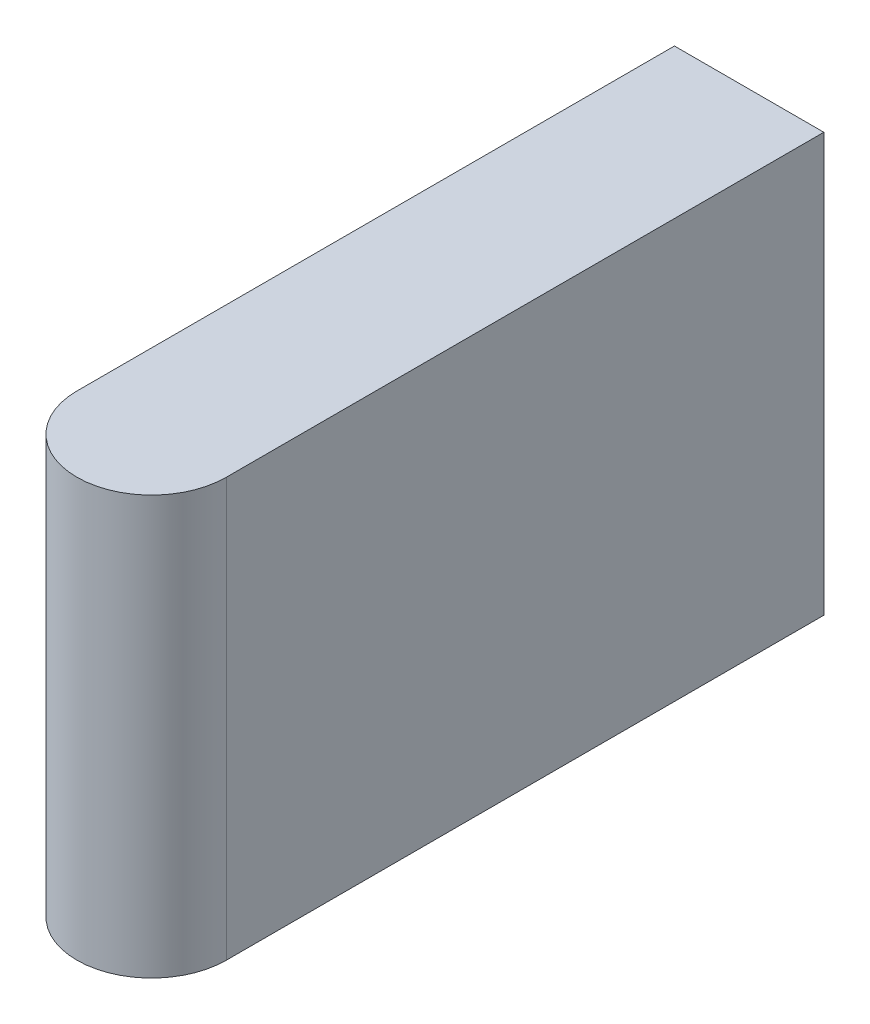
ISO-10303-21;
HEADER;
FILE_DESCRIPTION(('STEP AP214'),'2;1');
FILE_NAME('part.step','',(''),(''),'','','');
FILE_SCHEMA(('AUTOMOTIVE_DESIGN { 1 0 10303 214 1 1 1 1 }'));
ENDSEC;
DATA;
#1=APPLICATION_CONTEXT('core data for automotive mechanical design processes');
#2=APPLICATION_PROTOCOL_DEFINITION('international standard','automotive_design',2000,#1);
#3=PRODUCT_CONTEXT('',#1,'mechanical');
#4=PRODUCT('Part','Part','',(#3));
#5=PRODUCT_RELATED_PRODUCT_CATEGORY('part','',(#4));
#6=PRODUCT_DEFINITION_FORMATION('','',#4);
#7=PRODUCT_DEFINITION_CONTEXT('part definition',#1,'design');
#8=PRODUCT_DEFINITION('design','',#6,#7);
#9=PRODUCT_DEFINITION_SHAPE('','',#8);
#10=(LENGTH_UNIT() NAMED_UNIT(*) SI_UNIT(.MILLI.,.METRE.));
#11=(NAMED_UNIT(*) PLANE_ANGLE_UNIT() SI_UNIT($,.RADIAN.));
#12=(NAMED_UNIT(*) SI_UNIT($,.STERADIAN.) SOLID_ANGLE_UNIT());
#13=UNCERTAINTY_MEASURE_WITH_UNIT(LENGTH_MEASURE(1.E-05),#10,'distance_accuracy_value','');
#14=(GEOMETRIC_REPRESENTATION_CONTEXT(3) GLOBAL_UNCERTAINTY_ASSIGNED_CONTEXT((#13)) GLOBAL_UNIT_ASSIGNED_CONTEXT((#10,
#11,#12)) REPRESENTATION_CONTEXT('',''));
#15=CARTESIAN_POINT('',(0.,0.,0.));
#16=DIRECTION('',(0.,0.,1.));
#17=DIRECTION('',(1.,0.,0.));
#18=AXIS2_PLACEMENT_3D('',#15,#16,#17);
#19=CARTESIAN_POINT('',(-0.499999999999999,1.4,0.));
#20=DIRECTION('',(0.,0.,1.));
#21=DIRECTION('',(1.,0.,0.));
#22=AXIS2_PLACEMENT_3D('',#19,#20,#21);
#23=PLANE('',#22);
#24=DIRECTION('',(-1.,0.,0.));
#25=VECTOR('',#24,1.);
#26=CARTESIAN_POINT('',(-0.499999999999999,-1.4,0.));
#27=LINE('',#26,#25);
#28=CARTESIAN_POINT('',(0.500000000000002,-1.4,0.));
#29=VERTEX_POINT('',#28);
#30=CARTESIAN_POINT('',(-0.499999999999999,-1.4,0.));
#31=VERTEX_POINT('',#30);
#32=EDGE_CURVE('E76',#29,#31,#27,.T.);
#33=ORIENTED_EDGE('',*,*,#32,.T.);
#34=DIRECTION('',(0.,-1.,0.));
#35=VECTOR('',#34,1.);
#36=CARTESIAN_POINT('',(-0.499999999999999,1.4,0.));
#37=LINE('',#36,#35);
#38=CARTESIAN_POINT('',(-0.499999999999999,1.4,0.));
#39=VERTEX_POINT('',#38);
#40=EDGE_CURVE('E11',#39,#31,#37,.T.);
#41=ORIENTED_EDGE('',*,*,#40,.F.);
#42=DIRECTION('',(-1.,0.,0.));
#43=VECTOR('',#42,1.);
#44=CARTESIAN_POINT('',(-0.499999999999999,1.4,0.));
#45=LINE('',#44,#43);
#46=CARTESIAN_POINT('',(0.500000000000002,1.4,0.));
#47=VERTEX_POINT('',#46);
#48=EDGE_CURVE('E94',#47,#39,#45,.T.);
#49=ORIENTED_EDGE('',*,*,#48,.F.);
#50=DIRECTION('',(0.,-1.,0.));
#51=VECTOR('',#50,1.);
#52=CARTESIAN_POINT('',(0.500000000000002,1.4,0.));
#53=LINE('',#52,#51);
#54=EDGE_CURVE('E88',#47,#29,#53,.T.);
#55=ORIENTED_EDGE('',*,*,#54,.T.);
#56=EDGE_LOOP('',(#33,#41,#49,#55));
#57=FACE_BOUND('',#56,.T.);
#58=ADVANCED_FACE('F32',(#57),#23,.F.);
#59=CARTESIAN_POINT('',(-0.499999999999999,1.4,0.));
#60=DIRECTION('',(1.,0.,0.));
#61=DIRECTION('',(0.,0.,-1.));
#62=AXIS2_PLACEMENT_3D('',#59,#60,#61);
#63=PLANE('',#62);
#64=DIRECTION('',(0.,0.,1.));
#65=VECTOR('',#64,1.);
#66=CARTESIAN_POINT('',(-0.499999999999999,-1.4,0.));
#67=LINE('',#66,#65);
#68=CARTESIAN_POINT('',(-0.5,-1.4,4.));
#69=VERTEX_POINT('',#68);
#70=EDGE_CURVE('E72',#31,#69,#67,.T.);
#71=ORIENTED_EDGE('',*,*,#70,.T.);
#72=DIRECTION('',(0.,-1.,0.));
#73=VECTOR('',#72,1.);
#74=CARTESIAN_POINT('',(-0.5,1.4,4.));
#75=LINE('',#74,#73);
#76=CARTESIAN_POINT('',(-0.5,1.4,4.));
#77=VERTEX_POINT('',#76);
#78=EDGE_CURVE('E39',#77,#69,#75,.T.);
#79=ORIENTED_EDGE('',*,*,#78,.F.);
#80=DIRECTION('',(0.,0.,1.));
#81=VECTOR('',#80,1.);
#82=CARTESIAN_POINT('',(-0.499999999999999,1.4,0.));
#83=LINE('',#82,#81);
#84=EDGE_CURVE('E84',#39,#77,#83,.T.);
#85=ORIENTED_EDGE('',*,*,#84,.F.);
#86=ORIENTED_EDGE('',*,*,#40,.T.);
#87=EDGE_LOOP('',(#71,#79,#85,#86));
#88=FACE_BOUND('',#87,.T.);
#89=ADVANCED_FACE('F83',(#88),#63,.F.);
#90=CARTESIAN_POINT('',(0.,1.4,4.));
#91=DIRECTION('',(0.,-1.,0.));
#92=DIRECTION('',(0.,0.,-1.));
#93=AXIS2_PLACEMENT_3D('',#90,#91,#92);
#94=CYLINDRICAL_SURFACE('',#93,0.5);
#95=CARTESIAN_POINT('',(0.,-1.4,4.));
#96=DIRECTION('',(0.,1.,0.));
#97=DIRECTION('',(0.,0.,1.));
#98=AXIS2_PLACEMENT_3D('',#95,#96,#97);
#99=CIRCLE('',#98,0.5);
#100=CARTESIAN_POINT('',(0.500000000000001,-1.4,4.));
#101=VERTEX_POINT('',#100);
#102=EDGE_CURVE('E77',#69,#101,#99,.T.);
#103=ORIENTED_EDGE('',*,*,#102,.T.);
#104=DIRECTION('',(0.,-1.,0.));
#105=VECTOR('',#104,1.);
#106=CARTESIAN_POINT('',(0.500000000000001,1.4,4.));
#107=LINE('',#106,#105);
#108=CARTESIAN_POINT('',(0.500000000000001,1.4,4.));
#109=VERTEX_POINT('',#108);
#110=EDGE_CURVE('E100',#109,#101,#107,.T.);
#111=ORIENTED_EDGE('',*,*,#110,.F.);
#112=CARTESIAN_POINT('',(0.,1.4,4.));
#113=DIRECTION('',(0.,1.,0.));
#114=DIRECTION('',(0.,0.,1.));
#115=AXIS2_PLACEMENT_3D('',#112,#113,#114);
#116=CIRCLE('',#115,0.5);
#117=EDGE_CURVE('E51',#77,#109,#116,.T.);
#118=ORIENTED_EDGE('',*,*,#117,.F.);
#119=ORIENTED_EDGE('',*,*,#78,.T.);
#120=EDGE_LOOP('',(#103,#111,#118,#119));
#121=FACE_BOUND('',#120,.T.);
#122=ADVANCED_FACE('F103',(#121),#94,.T.);
#123=CARTESIAN_POINT('',(0.500000000000002,1.4,0.));
#124=DIRECTION('',(-1.,0.,0.));
#125=DIRECTION('',(0.,0.,1.));
#126=AXIS2_PLACEMENT_3D('',#123,#124,#125);
#127=PLANE('',#126);
#128=DIRECTION('',(0.,0.,-1.));
#129=VECTOR('',#128,1.);
#130=CARTESIAN_POINT('',(0.500000000000002,-1.4,0.));
#131=LINE('',#130,#129);
#132=EDGE_CURVE('E92',#101,#29,#131,.T.);
#133=ORIENTED_EDGE('',*,*,#132,.T.);
#134=ORIENTED_EDGE('',*,*,#54,.F.);
#135=DIRECTION('',(0.,0.,-1.));
#136=VECTOR('',#135,1.);
#137=CARTESIAN_POINT('',(0.500000000000002,1.4,0.));
#138=LINE('',#137,#136);
#139=EDGE_CURVE('E46',#109,#47,#138,.T.);
#140=ORIENTED_EDGE('',*,*,#139,.F.);
#141=ORIENTED_EDGE('',*,*,#110,.T.);
#142=EDGE_LOOP('',(#133,#134,#140,#141));
#143=FACE_BOUND('',#142,.T.);
#144=ADVANCED_FACE('F105',(#143),#127,.F.);
#145=CARTESIAN_POINT('',(0.,1.4,4.));
#146=DIRECTION('',(0.,1.,0.));
#147=DIRECTION('',(0.,0.,1.));
#148=AXIS2_PLACEMENT_3D('',#145,#146,#147);
#149=PLANE('',#148);
#150=ORIENTED_EDGE('',*,*,#48,.T.);
#151=ORIENTED_EDGE('',*,*,#84,.T.);
#152=ORIENTED_EDGE('',*,*,#117,.T.);
#153=ORIENTED_EDGE('',*,*,#139,.T.);
#154=EDGE_LOOP('',(#150,#151,#152,#153));
#155=FACE_BOUND('',#154,.T.);
#156=ADVANCED_FACE('F106',(#155),#149,.T.);
#157=CARTESIAN_POINT('',(0.,-1.4,4.));
#158=DIRECTION('',(0.,1.,0.));
#159=DIRECTION('',(0.,0.,1.));
#160=AXIS2_PLACEMENT_3D('',#157,#158,#159);
#161=PLANE('',#160);
#162=ORIENTED_EDGE('',*,*,#32,.F.);
#163=ORIENTED_EDGE('',*,*,#132,.F.);
#164=ORIENTED_EDGE('',*,*,#102,.F.);
#165=ORIENTED_EDGE('',*,*,#70,.F.);
#166=EDGE_LOOP('',(#162,#163,#164,#165));
#167=FACE_BOUND('',#166,.T.);
#168=ADVANCED_FACE('F73',(#167),#161,.F.);
#169=CLOSED_SHELL('',(#58,#89,#122,#144,#156,#168));
#170=MANIFOLD_SOLID_BREP('B2',#169);
#171=ADVANCED_BREP_SHAPE_REPRESENTATION('',(#18,#170),#14);
#172=SHAPE_DEFINITION_REPRESENTATION(#9,#171);
ENDSEC;
END-ISO-10303-21;
